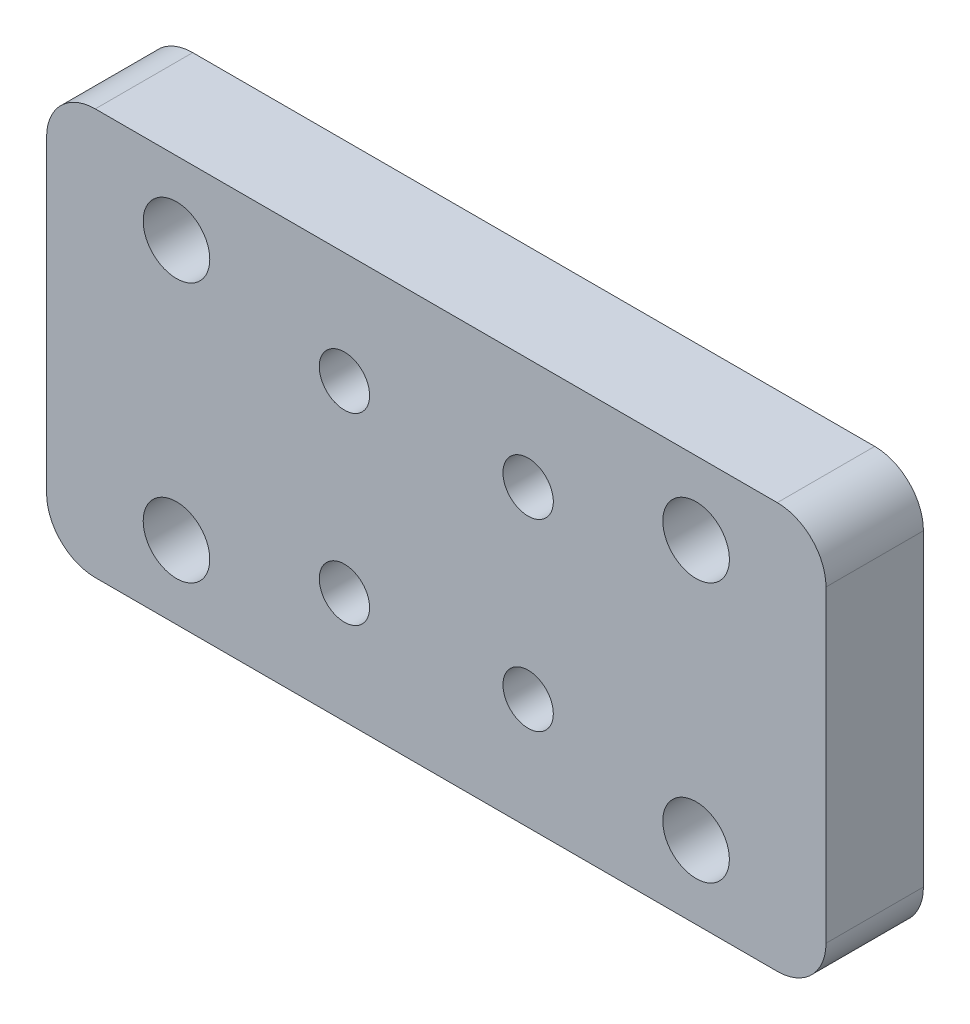
ISO-10303-21;
HEADER;
FILE_DESCRIPTION(('STEP AP214'),'2;1');
FILE_NAME('part.step','',(''),(''),'','','');
FILE_SCHEMA(('AUTOMOTIVE_DESIGN { 1 0 10303 214 1 1 1 1 }'));
ENDSEC;
DATA;
#1=APPLICATION_CONTEXT('core data for automotive mechanical design processes');
#2=APPLICATION_PROTOCOL_DEFINITION('international standard','automotive_design',2000,#1);
#3=PRODUCT_CONTEXT('',#1,'mechanical');
#4=PRODUCT('Part','Part','',(#3));
#5=PRODUCT_RELATED_PRODUCT_CATEGORY('part','',(#4));
#6=PRODUCT_DEFINITION_FORMATION('','',#4);
#7=PRODUCT_DEFINITION_CONTEXT('part definition',#1,'design');
#8=PRODUCT_DEFINITION('design','',#6,#7);
#9=PRODUCT_DEFINITION_SHAPE('','',#8);
#10=(LENGTH_UNIT() NAMED_UNIT(*) SI_UNIT(.MILLI.,.METRE.));
#11=(NAMED_UNIT(*) PLANE_ANGLE_UNIT() SI_UNIT($,.RADIAN.));
#12=(NAMED_UNIT(*) SI_UNIT($,.STERADIAN.) SOLID_ANGLE_UNIT());
#13=UNCERTAINTY_MEASURE_WITH_UNIT(LENGTH_MEASURE(1.E-05),#10,'distance_accuracy_value','');
#14=(GEOMETRIC_REPRESENTATION_CONTEXT(3) GLOBAL_UNCERTAINTY_ASSIGNED_CONTEXT((#13)) GLOBAL_UNIT_ASSIGNED_CONTEXT((#10,
#11,#12)) REPRESENTATION_CONTEXT('',''));
#15=CARTESIAN_POINT('',(0.,0.,0.));
#16=DIRECTION('',(0.,0.,1.));
#17=DIRECTION('',(1.,0.,0.));
#18=AXIS2_PLACEMENT_3D('',#15,#16,#17);
#19=CARTESIAN_POINT('',(-23.3664122137404,7.53435114503817,6.));
#20=DIRECTION('',(0.,0.,1.));
#21=DIRECTION('',(1.,0.,0.));
#22=AXIS2_PLACEMENT_3D('',#19,#20,#21);
#23=CYLINDRICAL_SURFACE('',#22,3.);
#24=DIRECTION('',(0.,0.,1.));
#25=VECTOR('',#24,1.);
#26=CARTESIAN_POINT('',(-23.3664122137404,10.5343511450382,6.));
#27=LINE('',#26,#25);
#28=CARTESIAN_POINT('',(-23.3664122137404,10.5343511450382,0.));
#29=VERTEX_POINT('',#28);
#30=CARTESIAN_POINT('',(-23.3664122137404,10.5343511450382,6.));
#31=VERTEX_POINT('',#30);
#32=EDGE_CURVE('E176',#29,#31,#27,.T.);
#33=ORIENTED_EDGE('',*,*,#32,.F.);
#34=CARTESIAN_POINT('',(-23.3664122137404,7.53435114503817,0.));
#35=DIRECTION('',(0.,0.,1.));
#36=DIRECTION('',(1.,0.,0.));
#37=AXIS2_PLACEMENT_3D('',#34,#35,#36);
#38=CIRCLE('',#37,3.);
#39=CARTESIAN_POINT('',(-26.3664122137404,7.53435114503817,0.));
#40=VERTEX_POINT('',#39);
#41=EDGE_CURVE('E47',#40,#29,#38,.F.);
#42=ORIENTED_EDGE('',*,*,#41,.F.);
#43=DIRECTION('',(0.,0.,1.));
#44=VECTOR('',#43,1.);
#45=CARTESIAN_POINT('',(-26.3664122137404,7.53435114503817,6.));
#46=LINE('',#45,#44);
#47=CARTESIAN_POINT('',(-26.3664122137404,7.53435114503817,6.));
#48=VERTEX_POINT('',#47);
#49=EDGE_CURVE('E180',#48,#40,#46,.F.);
#50=ORIENTED_EDGE('',*,*,#49,.F.);
#51=CARTESIAN_POINT('',(-23.3664122137404,7.53435114503817,6.));
#52=DIRECTION('',(0.,0.,1.));
#53=DIRECTION('',(1.,0.,0.));
#54=AXIS2_PLACEMENT_3D('',#51,#52,#53);
#55=CIRCLE('',#54,3.);
#56=EDGE_CURVE('E11',#31,#48,#55,.T.);
#57=ORIENTED_EDGE('',*,*,#56,.F.);
#58=EDGE_LOOP('',(#33,#42,#50,#57));
#59=FACE_BOUND('',#58,.T.);
#60=ADVANCED_FACE('F39',(#59),#23,.T.);
#61=CARTESIAN_POINT('',(18.6335877862596,7.53435114503817,6.));
#62=DIRECTION('',(0.,0.,-1.));
#63=DIRECTION('',(-1.,0.,0.));
#64=AXIS2_PLACEMENT_3D('',#61,#62,#63);
#65=CYLINDRICAL_SURFACE('',#64,3.);
#66=DIRECTION('',(0.,0.,-1.));
#67=VECTOR('',#66,1.);
#68=CARTESIAN_POINT('',(18.6335877862596,10.5343511450382,6.));
#69=LINE('',#68,#67);
#70=CARTESIAN_POINT('',(18.6335877862596,10.5343511450382,6.));
#71=VERTEX_POINT('',#70);
#72=CARTESIAN_POINT('',(18.6335877862596,10.5343511450382,0.));
#73=VERTEX_POINT('',#72);
#74=EDGE_CURVE('E164',#71,#73,#69,.T.);
#75=ORIENTED_EDGE('',*,*,#74,.F.);
#76=CARTESIAN_POINT('',(18.6335877862596,7.53435114503817,6.));
#77=DIRECTION('',(0.,0.,1.));
#78=DIRECTION('',(1.,0.,0.));
#79=AXIS2_PLACEMENT_3D('',#76,#77,#78);
#80=CIRCLE('',#79,3.);
#81=CARTESIAN_POINT('',(21.6335877862596,7.53435114503818,6.));
#82=VERTEX_POINT('',#81);
#83=EDGE_CURVE('E171',#82,#71,#80,.T.);
#84=ORIENTED_EDGE('',*,*,#83,.F.);
#85=DIRECTION('',(0.,0.,-1.));
#86=VECTOR('',#85,1.);
#87=CARTESIAN_POINT('',(21.6335877862596,7.53435114503817,6.));
#88=LINE('',#87,#86);
#89=CARTESIAN_POINT('',(21.6335877862596,7.53435114503818,0.));
#90=VERTEX_POINT('',#89);
#91=EDGE_CURVE('E168',#90,#82,#88,.F.);
#92=ORIENTED_EDGE('',*,*,#91,.F.);
#93=CARTESIAN_POINT('',(18.6335877862596,7.53435114503817,0.));
#94=DIRECTION('',(0.,0.,1.));
#95=DIRECTION('',(1.,0.,0.));
#96=AXIS2_PLACEMENT_3D('',#93,#94,#95);
#97=CIRCLE('',#96,3.);
#98=EDGE_CURVE('E131',#73,#90,#97,.F.);
#99=ORIENTED_EDGE('',*,*,#98,.F.);
#100=EDGE_LOOP('',(#75,#84,#92,#99));
#101=FACE_BOUND('',#100,.T.);
#102=ADVANCED_FACE('F188',(#101),#65,.T.);
#103=CARTESIAN_POINT('',(-23.3664122137404,-11.4656488549618,6.));
#104=DIRECTION('',(0.,0.,-1.));
#105=DIRECTION('',(-1.,0.,0.));
#106=AXIS2_PLACEMENT_3D('',#103,#104,#105);
#107=CYLINDRICAL_SURFACE('',#106,3.);
#108=DIRECTION('',(0.,0.,-1.));
#109=VECTOR('',#108,1.);
#110=CARTESIAN_POINT('',(-23.3664122137404,-14.4656488549618,6.));
#111=LINE('',#110,#109);
#112=CARTESIAN_POINT('',(-23.3664122137404,-14.4656488549618,6.));
#113=VERTEX_POINT('',#112);
#114=CARTESIAN_POINT('',(-23.3664122137404,-14.4656488549618,0.));
#115=VERTEX_POINT('',#114);
#116=EDGE_CURVE('E114',#113,#115,#111,.T.);
#117=ORIENTED_EDGE('',*,*,#116,.F.);
#118=CARTESIAN_POINT('',(-23.3664122137404,-11.4656488549618,6.));
#119=DIRECTION('',(0.,0.,1.));
#120=DIRECTION('',(1.,0.,0.));
#121=AXIS2_PLACEMENT_3D('',#118,#119,#120);
#122=CIRCLE('',#121,3.);
#123=CARTESIAN_POINT('',(-26.3664122137404,-11.4656488549618,6.));
#124=VERTEX_POINT('',#123);
#125=EDGE_CURVE('E157',#124,#113,#122,.T.);
#126=ORIENTED_EDGE('',*,*,#125,.F.);
#127=DIRECTION('',(0.,0.,-1.));
#128=VECTOR('',#127,1.);
#129=CARTESIAN_POINT('',(-26.3664122137404,-11.4656488549618,6.));
#130=LINE('',#129,#128);
#131=CARTESIAN_POINT('',(-26.3664122137404,-11.4656488549618,0.));
#132=VERTEX_POINT('',#131);
#133=EDGE_CURVE('E153',#132,#124,#130,.F.);
#134=ORIENTED_EDGE('',*,*,#133,.F.);
#135=CARTESIAN_POINT('',(-23.3664122137404,-11.4656488549618,0.));
#136=DIRECTION('',(0.,0.,1.));
#137=DIRECTION('',(1.,0.,0.));
#138=AXIS2_PLACEMENT_3D('',#135,#136,#137);
#139=CIRCLE('',#138,3.);
#140=EDGE_CURVE('E160',#115,#132,#139,.F.);
#141=ORIENTED_EDGE('',*,*,#140,.F.);
#142=EDGE_LOOP('',(#117,#126,#134,#141));
#143=FACE_BOUND('',#142,.T.);
#144=ADVANCED_FACE('F221',(#143),#107,.T.);
#145=CARTESIAN_POINT('',(18.6335877862596,-11.4656488549618,6.));
#146=DIRECTION('',(0.,0.,-1.));
#147=DIRECTION('',(-1.,0.,0.));
#148=AXIS2_PLACEMENT_3D('',#145,#146,#147);
#149=CYLINDRICAL_SURFACE('',#148,3.);
#150=DIRECTION('',(0.,0.,-1.));
#151=VECTOR('',#150,1.);
#152=CARTESIAN_POINT('',(21.6335877862596,-11.4656488549618,6.));
#153=LINE('',#152,#151);
#154=CARTESIAN_POINT('',(21.6335877862596,-11.4656488549618,6.));
#155=VERTEX_POINT('',#154);
#156=CARTESIAN_POINT('',(21.6335877862596,-11.4656488549618,0.));
#157=VERTEX_POINT('',#156);
#158=EDGE_CURVE('E106',#155,#157,#153,.T.);
#159=ORIENTED_EDGE('',*,*,#158,.F.);
#160=CARTESIAN_POINT('',(18.6335877862596,-11.4656488549618,6.));
#161=DIRECTION('',(0.,0.,1.));
#162=DIRECTION('',(1.,0.,0.));
#163=AXIS2_PLACEMENT_3D('',#160,#161,#162);
#164=CIRCLE('',#163,3.);
#165=CARTESIAN_POINT('',(18.6335877862596,-14.4656488549618,6.));
#166=VERTEX_POINT('',#165);
#167=EDGE_CURVE('E115',#166,#155,#164,.T.);
#168=ORIENTED_EDGE('',*,*,#167,.F.);
#169=DIRECTION('',(0.,0.,-1.));
#170=VECTOR('',#169,1.);
#171=CARTESIAN_POINT('',(18.6335877862596,-14.4656488549618,6.));
#172=LINE('',#171,#170);
#173=CARTESIAN_POINT('',(18.6335877862596,-14.4656488549618,0.));
#174=VERTEX_POINT('',#173);
#175=EDGE_CURVE('E109',#174,#166,#172,.F.);
#176=ORIENTED_EDGE('',*,*,#175,.F.);
#177=CARTESIAN_POINT('',(18.6335877862596,-11.4656488549618,0.));
#178=DIRECTION('',(0.,0.,1.));
#179=DIRECTION('',(1.,0.,0.));
#180=AXIS2_PLACEMENT_3D('',#177,#178,#179);
#181=CIRCLE('',#180,3.);
#182=EDGE_CURVE('E102',#157,#174,#181,.F.);
#183=ORIENTED_EDGE('',*,*,#182,.F.);
#184=EDGE_LOOP('',(#159,#168,#176,#183));
#185=FACE_BOUND('',#184,.T.);
#186=ADVANCED_FACE('F104',(#185),#149,.T.);
#187=CARTESIAN_POINT('',(0.,0.,6.));
#188=DIRECTION('',(0.,0.,1.));
#189=DIRECTION('',(1.,0.,0.));
#190=AXIS2_PLACEMENT_3D('',#187,#188,#189);
#191=PLANE('',#190);
#192=CARTESIAN_POINT('',(13.6335877862595,-9.96564885496182,6.));
#193=DIRECTION('',(0.,0.,1.));
#194=DIRECTION('',(1.,0.,0.));
#195=AXIS2_PLACEMENT_3D('',#192,#193,#194);
#196=CIRCLE('',#195,2.04999999999998);
#197=CARTESIAN_POINT('',(15.6835877862595,-9.96564885496182,6.));
#198=VERTEX_POINT('',#197);
#199=EDGE_CURVE('E400',#198,#198,#196,.T.);
#200=ORIENTED_EDGE('',*,*,#199,.F.);
#201=EDGE_LOOP('',(#200));
#202=FACE_BOUND('',#201,.T.);
#203=CARTESIAN_POINT('',(3.29044203575195,3.69120539453055,6.));
#204=DIRECTION('',(0.,0.,1.));
#205=DIRECTION('',(-1.,0.,0.));
#206=AXIS2_PLACEMENT_3D('',#203,#204,#205);
#207=CIRCLE('',#206,1.55);
#208=CARTESIAN_POINT('',(1.74044203575195,3.69120539453055,6.));
#209=VERTEX_POINT('',#208);
#210=EDGE_CURVE('E416',#209,#209,#207,.T.);
#211=ORIENTED_EDGE('',*,*,#210,.F.);
#212=EDGE_LOOP('',(#211));
#213=FACE_BOUND('',#212,.T.);
#214=CARTESIAN_POINT('',(-18.3664122137405,6.03435114503817,6.));
#215=DIRECTION('',(0.,0.,1.));
#216=DIRECTION('',(1.,0.,0.));
#217=AXIS2_PLACEMENT_3D('',#214,#215,#216);
#218=CIRCLE('',#217,2.05);
#219=CARTESIAN_POINT('',(-16.3164122137405,6.03435114503817,6.));
#220=VERTEX_POINT('',#219);
#221=EDGE_CURVE('E432',#220,#220,#218,.T.);
#222=ORIENTED_EDGE('',*,*,#221,.F.);
#223=EDGE_LOOP('',(#222));
#224=FACE_BOUND('',#223,.T.);
#225=CARTESIAN_POINT('',(-8.02326646323283,3.69120539453055,6.));
#226=DIRECTION('',(0.,0.,1.));
#227=DIRECTION('',(1.,0.,0.));
#228=AXIS2_PLACEMENT_3D('',#225,#226,#227);
#229=CIRCLE('',#228,1.55);
#230=CARTESIAN_POINT('',(-6.47326646323283,3.69120539453055,6.));
#231=VERTEX_POINT('',#230);
#232=EDGE_CURVE('E200',#231,#231,#229,.T.);
#233=ORIENTED_EDGE('',*,*,#232,.F.);
#234=EDGE_LOOP('',(#233));
#235=FACE_BOUND('',#234,.T.);
#236=DIRECTION('',(-1.,0.,0.));
#237=VECTOR('',#236,1.);
#238=CARTESIAN_POINT('',(21.6335877862596,10.5343511450382,6.));
#239=LINE('',#238,#237);
#240=EDGE_CURVE('E125',#71,#31,#239,.T.);
#241=ORIENTED_EDGE('',*,*,#240,.T.);
#242=ORIENTED_EDGE('',*,*,#56,.T.);
#243=DIRECTION('',(0.,-1.,0.));
#244=VECTOR('',#243,1.);
#245=CARTESIAN_POINT('',(-26.3664122137404,-14.4656488549618,6.));
#246=LINE('',#245,#244);
#247=EDGE_CURVE('E140',#48,#124,#246,.T.);
#248=ORIENTED_EDGE('',*,*,#247,.T.);
#249=ORIENTED_EDGE('',*,*,#125,.T.);
#250=DIRECTION('',(1.,0.,0.));
#251=VECTOR('',#250,1.);
#252=CARTESIAN_POINT('',(21.6335877862596,-14.4656488549618,6.));
#253=LINE('',#252,#251);
#254=EDGE_CURVE('E192',#113,#166,#253,.T.);
#255=ORIENTED_EDGE('',*,*,#254,.T.);
#256=ORIENTED_EDGE('',*,*,#167,.T.);
#257=DIRECTION('',(0.,1.,0.));
#258=VECTOR('',#257,1.);
#259=CARTESIAN_POINT('',(21.6335877862596,-14.4656488549618,6.));
#260=LINE('',#259,#258);
#261=EDGE_CURVE('E123',#155,#82,#260,.T.);
#262=ORIENTED_EDGE('',*,*,#261,.T.);
#263=ORIENTED_EDGE('',*,*,#83,.T.);
#264=EDGE_LOOP('',(#241,#242,#248,#249,#255,#256,#262,#263));
#265=FACE_BOUND('',#264,.T.);
#266=CARTESIAN_POINT('',(-8.02326646323283,-7.62250310445422,6.));
#267=DIRECTION('',(0.,0.,1.));
#268=DIRECTION('',(-1.,0.,0.));
#269=AXIS2_PLACEMENT_3D('',#266,#267,#268);
#270=CIRCLE('',#269,1.55);
#271=CARTESIAN_POINT('',(-9.57326646323283,-7.62250310445422,6.));
#272=VERTEX_POINT('',#271);
#273=EDGE_CURVE('E210',#272,#272,#270,.T.);
#274=ORIENTED_EDGE('',*,*,#273,.F.);
#275=EDGE_LOOP('',(#274));
#276=FACE_BOUND('',#275,.T.);
#277=CARTESIAN_POINT('',(3.29044203575195,-7.62250310445422,6.));
#278=DIRECTION('',(0.,0.,1.));
#279=DIRECTION('',(1.,0.,0.));
#280=AXIS2_PLACEMENT_3D('',#277,#278,#279);
#281=CIRCLE('',#280,1.55);
#282=CARTESIAN_POINT('',(4.84044203575195,-7.62250310445422,6.));
#283=VERTEX_POINT('',#282);
#284=EDGE_CURVE('E424',#283,#283,#281,.T.);
#285=ORIENTED_EDGE('',*,*,#284,.F.);
#286=EDGE_LOOP('',(#285));
#287=FACE_BOUND('',#286,.T.);
#288=CARTESIAN_POINT('',(13.6335877862595,6.03435114503818,6.));
#289=DIRECTION('',(0.,0.,1.));
#290=DIRECTION('',(-1.,0.,0.));
#291=AXIS2_PLACEMENT_3D('',#288,#289,#290);
#292=CIRCLE('',#291,2.04999999999997);
#293=CARTESIAN_POINT('',(11.5835877862596,6.03435114503818,6.));
#294=VERTEX_POINT('',#293);
#295=EDGE_CURVE('E408',#294,#294,#292,.T.);
#296=ORIENTED_EDGE('',*,*,#295,.F.);
#297=EDGE_LOOP('',(#296));
#298=FACE_BOUND('',#297,.T.);
#299=CARTESIAN_POINT('',(-18.3664122137405,-9.96564885496183,6.));
#300=DIRECTION('',(0.,0.,1.));
#301=DIRECTION('',(-1.,0.,0.));
#302=AXIS2_PLACEMENT_3D('',#299,#300,#301);
#303=CIRCLE('',#302,2.05);
#304=CARTESIAN_POINT('',(-20.4164122137405,-9.96564885496183,6.));
#305=VERTEX_POINT('',#304);
#306=EDGE_CURVE('E389',#305,#305,#303,.T.);
#307=ORIENTED_EDGE('',*,*,#306,.F.);
#308=EDGE_LOOP('',(#307));
#309=FACE_BOUND('',#308,.T.);
#310=ADVANCED_FACE('F189',(#202,#213,#224,#235,#265,#276,#287,#298,#309),#191,.T.);
#311=CARTESIAN_POINT('',(0.,0.,0.));
#312=DIRECTION('',(0.,0.,1.));
#313=DIRECTION('',(1.,0.,0.));
#314=AXIS2_PLACEMENT_3D('',#311,#312,#313);
#315=PLANE('',#314);
#316=DIRECTION('',(0.,-1.,0.));
#317=VECTOR('',#316,1.);
#318=CARTESIAN_POINT('',(-26.3664122137404,-14.4656488549618,0.));
#319=LINE('',#318,#317);
#320=EDGE_CURVE('E142',#40,#132,#319,.T.);
#321=ORIENTED_EDGE('',*,*,#320,.F.);
#322=ORIENTED_EDGE('',*,*,#41,.T.);
#323=DIRECTION('',(-1.,0.,0.));
#324=VECTOR('',#323,1.);
#325=CARTESIAN_POINT('',(21.6335877862596,10.5343511450382,0.));
#326=LINE('',#325,#324);
#327=EDGE_CURVE('E134',#73,#29,#326,.T.);
#328=ORIENTED_EDGE('',*,*,#327,.F.);
#329=ORIENTED_EDGE('',*,*,#98,.T.);
#330=DIRECTION('',(0.,1.,0.));
#331=VECTOR('',#330,1.);
#332=CARTESIAN_POINT('',(21.6335877862596,-14.4656488549618,0.));
#333=LINE('',#332,#331);
#334=EDGE_CURVE('E121',#157,#90,#333,.T.);
#335=ORIENTED_EDGE('',*,*,#334,.F.);
#336=ORIENTED_EDGE('',*,*,#182,.T.);
#337=DIRECTION('',(1.,0.,0.));
#338=VECTOR('',#337,1.);
#339=CARTESIAN_POINT('',(21.6335877862596,-14.4656488549618,0.));
#340=LINE('',#339,#338);
#341=EDGE_CURVE('E135',#115,#174,#340,.T.);
#342=ORIENTED_EDGE('',*,*,#341,.F.);
#343=ORIENTED_EDGE('',*,*,#140,.T.);
#344=EDGE_LOOP('',(#321,#322,#328,#329,#335,#336,#342,#343));
#345=FACE_BOUND('',#344,.T.);
#346=CARTESIAN_POINT('',(-8.02326646323283,3.69120539453055,0.));
#347=DIRECTION('',(0.,0.,1.));
#348=DIRECTION('',(1.,0.,0.));
#349=AXIS2_PLACEMENT_3D('',#346,#347,#348);
#350=CIRCLE('',#349,1.55);
#351=CARTESIAN_POINT('',(-6.47326646323283,3.69120539453055,0.));
#352=VERTEX_POINT('',#351);
#353=EDGE_CURVE('E204',#352,#352,#350,.T.);
#354=ORIENTED_EDGE('',*,*,#353,.T.);
#355=EDGE_LOOP('',(#354));
#356=FACE_BOUND('',#355,.T.);
#357=CARTESIAN_POINT('',(-8.02326646323283,-7.62250310445422,0.));
#358=DIRECTION('',(0.,0.,1.));
#359=DIRECTION('',(-1.,0.,0.));
#360=AXIS2_PLACEMENT_3D('',#357,#358,#359);
#361=CIRCLE('',#360,1.55);
#362=CARTESIAN_POINT('',(-9.57326646323283,-7.62250310445422,0.));
#363=VERTEX_POINT('',#362);
#364=EDGE_CURVE('E213',#363,#363,#361,.T.);
#365=ORIENTED_EDGE('',*,*,#364,.T.);
#366=EDGE_LOOP('',(#365));
#367=FACE_BOUND('',#366,.T.);
#368=CARTESIAN_POINT('',(-18.3664122137405,6.03435114503817,0.));
#369=DIRECTION('',(0.,0.,1.));
#370=DIRECTION('',(1.,0.,0.));
#371=AXIS2_PLACEMENT_3D('',#368,#369,#370);
#372=CIRCLE('',#371,2.05);
#373=CARTESIAN_POINT('',(-16.3164122137405,6.03435114503817,0.));
#374=VERTEX_POINT('',#373);
#375=EDGE_CURVE('E428',#374,#374,#372,.T.);
#376=ORIENTED_EDGE('',*,*,#375,.T.);
#377=EDGE_LOOP('',(#376));
#378=FACE_BOUND('',#377,.T.);
#379=CARTESIAN_POINT('',(3.29044203575195,-7.62250310445422,0.));
#380=DIRECTION('',(0.,0.,1.));
#381=DIRECTION('',(1.,0.,0.));
#382=AXIS2_PLACEMENT_3D('',#379,#380,#381);
#383=CIRCLE('',#382,1.55);
#384=CARTESIAN_POINT('',(4.84044203575195,-7.62250310445422,0.));
#385=VERTEX_POINT('',#384);
#386=EDGE_CURVE('E420',#385,#385,#383,.T.);
#387=ORIENTED_EDGE('',*,*,#386,.T.);
#388=EDGE_LOOP('',(#387));
#389=FACE_BOUND('',#388,.T.);
#390=CARTESIAN_POINT('',(3.29044203575195,3.69120539453055,0.));
#391=DIRECTION('',(0.,0.,1.));
#392=DIRECTION('',(-1.,0.,0.));
#393=AXIS2_PLACEMENT_3D('',#390,#391,#392);
#394=CIRCLE('',#393,1.55);
#395=CARTESIAN_POINT('',(1.74044203575195,3.69120539453055,0.));
#396=VERTEX_POINT('',#395);
#397=EDGE_CURVE('E412',#396,#396,#394,.T.);
#398=ORIENTED_EDGE('',*,*,#397,.T.);
#399=EDGE_LOOP('',(#398));
#400=FACE_BOUND('',#399,.T.);
#401=CARTESIAN_POINT('',(13.6335877862595,6.03435114503818,0.));
#402=DIRECTION('',(0.,0.,1.));
#403=DIRECTION('',(-1.,0.,0.));
#404=AXIS2_PLACEMENT_3D('',#401,#402,#403);
#405=CIRCLE('',#404,2.04999999999997);
#406=CARTESIAN_POINT('',(11.5835877862596,6.03435114503818,0.));
#407=VERTEX_POINT('',#406);
#408=EDGE_CURVE('E404',#407,#407,#405,.T.);
#409=ORIENTED_EDGE('',*,*,#408,.T.);
#410=EDGE_LOOP('',(#409));
#411=FACE_BOUND('',#410,.T.);
#412=CARTESIAN_POINT('',(13.6335877862595,-9.96564885496182,0.));
#413=DIRECTION('',(0.,0.,1.));
#414=DIRECTION('',(1.,0.,0.));
#415=AXIS2_PLACEMENT_3D('',#412,#413,#414);
#416=CIRCLE('',#415,2.04999999999998);
#417=CARTESIAN_POINT('',(15.6835877862595,-9.96564885496182,0.));
#418=VERTEX_POINT('',#417);
#419=EDGE_CURVE('E397',#418,#418,#416,.T.);
#420=ORIENTED_EDGE('',*,*,#419,.T.);
#421=EDGE_LOOP('',(#420));
#422=FACE_BOUND('',#421,.T.);
#423=CARTESIAN_POINT('',(-18.3664122137405,-9.96564885496183,0.));
#424=DIRECTION('',(0.,0.,1.));
#425=DIRECTION('',(-1.,0.,0.));
#426=AXIS2_PLACEMENT_3D('',#423,#424,#425);
#427=CIRCLE('',#426,2.05);
#428=CARTESIAN_POINT('',(-20.4164122137405,-9.96564885496183,0.));
#429=VERTEX_POINT('',#428);
#430=EDGE_CURVE('E392',#429,#429,#427,.T.);
#431=ORIENTED_EDGE('',*,*,#430,.T.);
#432=EDGE_LOOP('',(#431));
#433=FACE_BOUND('',#432,.T.);
#434=ADVANCED_FACE('F128',(#345,#356,#367,#378,#389,#400,#411,#422,#433),#315,.F.);
#435=CARTESIAN_POINT('',(-26.3664122137404,-14.4656488549618,6.));
#436=DIRECTION('',(1.,0.,0.));
#437=DIRECTION('',(0.,0.,-1.));
#438=AXIS2_PLACEMENT_3D('',#435,#436,#437);
#439=PLANE('',#438);
#440=ORIENTED_EDGE('',*,*,#247,.F.);
#441=ORIENTED_EDGE('',*,*,#49,.T.);
#442=ORIENTED_EDGE('',*,*,#320,.T.);
#443=ORIENTED_EDGE('',*,*,#133,.T.);
#444=EDGE_LOOP('',(#440,#441,#442,#443));
#445=FACE_BOUND('',#444,.T.);
#446=ADVANCED_FACE('F223',(#445),#439,.F.);
#447=CARTESIAN_POINT('',(21.6335877862596,-14.4656488549618,6.));
#448=DIRECTION('',(0.,1.,0.));
#449=DIRECTION('',(-1.,0.,0.));
#450=AXIS2_PLACEMENT_3D('',#447,#448,#449);
#451=PLANE('',#450);
#452=ORIENTED_EDGE('',*,*,#254,.F.);
#453=ORIENTED_EDGE('',*,*,#116,.T.);
#454=ORIENTED_EDGE('',*,*,#341,.T.);
#455=ORIENTED_EDGE('',*,*,#175,.T.);
#456=EDGE_LOOP('',(#452,#453,#454,#455));
#457=FACE_BOUND('',#456,.T.);
#458=ADVANCED_FACE('F225',(#457),#451,.F.);
#459=CARTESIAN_POINT('',(21.6335877862596,-14.4656488549618,6.));
#460=DIRECTION('',(-1.,0.,0.));
#461=DIRECTION('',(0.,0.,1.));
#462=AXIS2_PLACEMENT_3D('',#459,#460,#461);
#463=PLANE('',#462);
#464=ORIENTED_EDGE('',*,*,#334,.T.);
#465=ORIENTED_EDGE('',*,*,#91,.T.);
#466=ORIENTED_EDGE('',*,*,#261,.F.);
#467=ORIENTED_EDGE('',*,*,#158,.T.);
#468=EDGE_LOOP('',(#464,#465,#466,#467));
#469=FACE_BOUND('',#468,.T.);
#470=ADVANCED_FACE('F119',(#469),#463,.F.);
#471=CARTESIAN_POINT('',(21.6335877862596,10.5343511450382,6.));
#472=DIRECTION('',(0.,-1.,0.));
#473=DIRECTION('',(1.,0.,0.));
#474=AXIS2_PLACEMENT_3D('',#471,#472,#473);
#475=PLANE('',#474);
#476=ORIENTED_EDGE('',*,*,#327,.T.);
#477=ORIENTED_EDGE('',*,*,#32,.T.);
#478=ORIENTED_EDGE('',*,*,#240,.F.);
#479=ORIENTED_EDGE('',*,*,#74,.T.);
#480=EDGE_LOOP('',(#476,#477,#478,#479));
#481=FACE_BOUND('',#480,.T.);
#482=ADVANCED_FACE('F185',(#481),#475,.F.);
#483=CARTESIAN_POINT('',(-8.02326646323283,3.69120539453055,6.));
#484=DIRECTION('',(0.,0.,-1.));
#485=DIRECTION('',(-1.,0.,0.));
#486=AXIS2_PLACEMENT_3D('',#483,#484,#485);
#487=CYLINDRICAL_SURFACE('',#486,1.55);
#488=ORIENTED_EDGE('',*,*,#232,.T.);
#489=EDGE_LOOP('',(#488));
#490=FACE_BOUND('',#489,.T.);
#491=ORIENTED_EDGE('',*,*,#353,.F.);
#492=EDGE_LOOP('',(#491));
#493=FACE_BOUND('',#492,.T.);
#494=ADVANCED_FACE('F254',(#490,#493),#487,.F.);
#495=CARTESIAN_POINT('',(-8.02326646323283,-7.62250310445422,6.));
#496=DIRECTION('',(0.,0.,-1.));
#497=DIRECTION('',(-1.,0.,0.));
#498=AXIS2_PLACEMENT_3D('',#495,#496,#497);
#499=CYLINDRICAL_SURFACE('',#498,1.55);
#500=ORIENTED_EDGE('',*,*,#273,.T.);
#501=EDGE_LOOP('',(#500));
#502=FACE_BOUND('',#501,.T.);
#503=ORIENTED_EDGE('',*,*,#364,.F.);
#504=EDGE_LOOP('',(#503));
#505=FACE_BOUND('',#504,.T.);
#506=ADVANCED_FACE('F274',(#502,#505),#499,.F.);
#507=CARTESIAN_POINT('',(-18.3664122137405,6.03435114503817,6.));
#508=DIRECTION('',(0.,0.,-1.));
#509=DIRECTION('',(-1.,0.,0.));
#510=AXIS2_PLACEMENT_3D('',#507,#508,#509);
#511=CYLINDRICAL_SURFACE('',#510,2.05);
#512=ORIENTED_EDGE('',*,*,#221,.T.);
#513=EDGE_LOOP('',(#512));
#514=FACE_BOUND('',#513,.T.);
#515=ORIENTED_EDGE('',*,*,#375,.F.);
#516=EDGE_LOOP('',(#515));
#517=FACE_BOUND('',#516,.T.);
#518=ADVANCED_FACE('F280',(#514,#517),#511,.F.);
#519=CARTESIAN_POINT('',(3.29044203575195,-7.62250310445422,6.));
#520=DIRECTION('',(0.,0.,-1.));
#521=DIRECTION('',(-1.,0.,0.));
#522=AXIS2_PLACEMENT_3D('',#519,#520,#521);
#523=CYLINDRICAL_SURFACE('',#522,1.55);
#524=ORIENTED_EDGE('',*,*,#284,.T.);
#525=EDGE_LOOP('',(#524));
#526=FACE_BOUND('',#525,.T.);
#527=ORIENTED_EDGE('',*,*,#386,.F.);
#528=EDGE_LOOP('',(#527));
#529=FACE_BOUND('',#528,.T.);
#530=ADVANCED_FACE('F287',(#526,#529),#523,.F.);
#531=CARTESIAN_POINT('',(3.29044203575195,3.69120539453055,6.));
#532=DIRECTION('',(0.,0.,-1.));
#533=DIRECTION('',(-1.,0.,0.));
#534=AXIS2_PLACEMENT_3D('',#531,#532,#533);
#535=CYLINDRICAL_SURFACE('',#534,1.55);
#536=ORIENTED_EDGE('',*,*,#210,.T.);
#537=EDGE_LOOP('',(#536));
#538=FACE_BOUND('',#537,.T.);
#539=ORIENTED_EDGE('',*,*,#397,.F.);
#540=EDGE_LOOP('',(#539));
#541=FACE_BOUND('',#540,.T.);
#542=ADVANCED_FACE('F295',(#538,#541),#535,.F.);
#543=CARTESIAN_POINT('',(13.6335877862595,6.03435114503818,6.));
#544=DIRECTION('',(0.,0.,-1.));
#545=DIRECTION('',(-1.,0.,0.));
#546=AXIS2_PLACEMENT_3D('',#543,#544,#545);
#547=CYLINDRICAL_SURFACE('',#546,2.04999999999997);
#548=ORIENTED_EDGE('',*,*,#295,.T.);
#549=EDGE_LOOP('',(#548));
#550=FACE_BOUND('',#549,.T.);
#551=ORIENTED_EDGE('',*,*,#408,.F.);
#552=EDGE_LOOP('',(#551));
#553=FACE_BOUND('',#552,.T.);
#554=ADVANCED_FACE('F303',(#550,#553),#547,.F.);
#555=CARTESIAN_POINT('',(13.6335877862595,-9.96564885496182,6.));
#556=DIRECTION('',(0.,0.,-1.));
#557=DIRECTION('',(-1.,0.,0.));
#558=AXIS2_PLACEMENT_3D('',#555,#556,#557);
#559=CYLINDRICAL_SURFACE('',#558,2.04999999999998);
#560=ORIENTED_EDGE('',*,*,#199,.T.);
#561=EDGE_LOOP('',(#560));
#562=FACE_BOUND('',#561,.T.);
#563=ORIENTED_EDGE('',*,*,#419,.F.);
#564=EDGE_LOOP('',(#563));
#565=FACE_BOUND('',#564,.T.);
#566=ADVANCED_FACE('F311',(#562,#565),#559,.F.);
#567=CARTESIAN_POINT('',(-18.3664122137405,-9.96564885496183,6.));
#568=DIRECTION('',(0.,0.,-1.));
#569=DIRECTION('',(-1.,0.,0.));
#570=AXIS2_PLACEMENT_3D('',#567,#568,#569);
#571=CYLINDRICAL_SURFACE('',#570,2.05);
#572=ORIENTED_EDGE('',*,*,#306,.T.);
#573=EDGE_LOOP('',(#572));
#574=FACE_BOUND('',#573,.T.);
#575=ORIENTED_EDGE('',*,*,#430,.F.);
#576=EDGE_LOOP('',(#575));
#577=FACE_BOUND('',#576,.T.);
#578=ADVANCED_FACE('F319',(#574,#577),#571,.F.);
#579=CLOSED_SHELL('',(#60,#102,#144,#186,#310,#434,#446,#458,#470,#482,#494,#506,#518,#530,#542,
#554,#566,#578));
#580=MANIFOLD_SOLID_BREP('B2',#579);
#581=ADVANCED_BREP_SHAPE_REPRESENTATION('',(#18,#580),#14);
#582=SHAPE_DEFINITION_REPRESENTATION(#9,#581);
ENDSEC;
END-ISO-10303-21;
